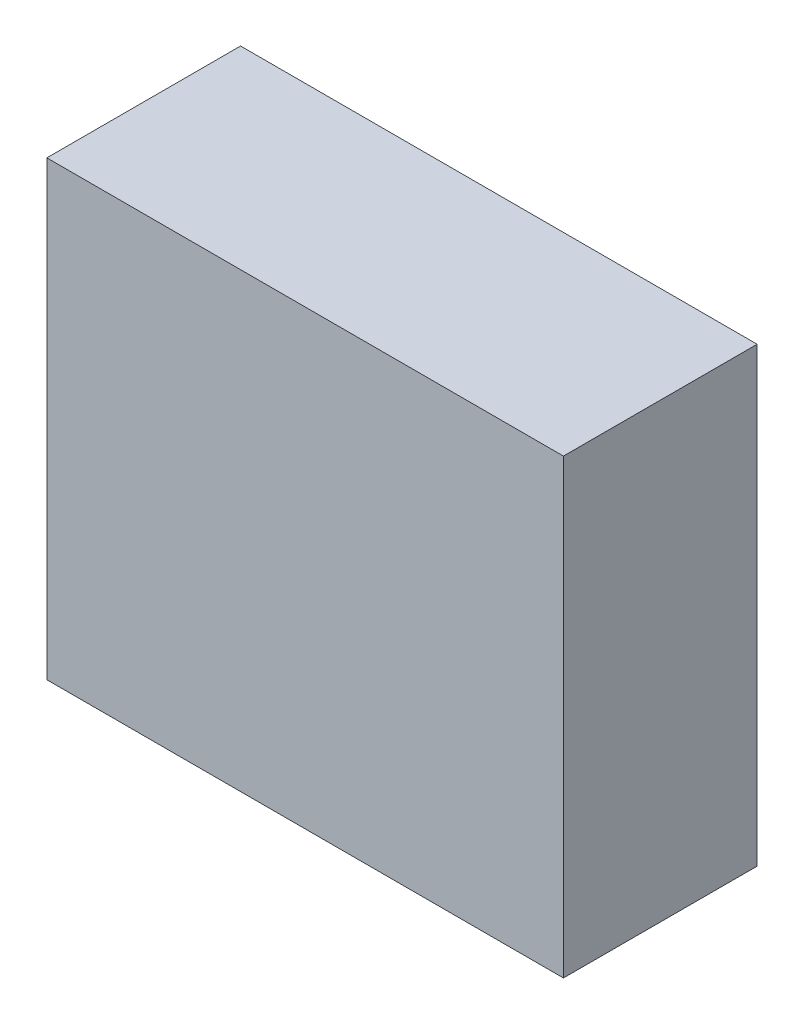
ISO-10303-21;
HEADER;
FILE_DESCRIPTION(('STEP AP214'),'2;1');
FILE_NAME('part.step','',(''),(''),'','','');
FILE_SCHEMA(('AUTOMOTIVE_DESIGN { 1 0 10303 214 1 1 1 1 }'));
ENDSEC;
DATA;
#1=APPLICATION_CONTEXT('core data for automotive mechanical design processes');
#2=APPLICATION_PROTOCOL_DEFINITION('international standard','automotive_design',2000,#1);
#3=PRODUCT_CONTEXT('',#1,'mechanical');
#4=PRODUCT('Part','Part','',(#3));
#5=PRODUCT_RELATED_PRODUCT_CATEGORY('part','',(#4));
#6=PRODUCT_DEFINITION_FORMATION('','',#4);
#7=PRODUCT_DEFINITION_CONTEXT('part definition',#1,'design');
#8=PRODUCT_DEFINITION('design','',#6,#7);
#9=PRODUCT_DEFINITION_SHAPE('','',#8);
#10=(LENGTH_UNIT() NAMED_UNIT(*) SI_UNIT(.MILLI.,.METRE.));
#11=(NAMED_UNIT(*) PLANE_ANGLE_UNIT() SI_UNIT($,.RADIAN.));
#12=(NAMED_UNIT(*) SI_UNIT($,.STERADIAN.) SOLID_ANGLE_UNIT());
#13=UNCERTAINTY_MEASURE_WITH_UNIT(LENGTH_MEASURE(1.E-05),#10,'distance_accuracy_value','');
#14=(GEOMETRIC_REPRESENTATION_CONTEXT(3) GLOBAL_UNCERTAINTY_ASSIGNED_CONTEXT((#13)) GLOBAL_UNIT_ASSIGNED_CONTEXT((#10,
#11,#12)) REPRESENTATION_CONTEXT('',''));
#15=CARTESIAN_POINT('',(0.,0.,0.));
#16=DIRECTION('',(0.,0.,1.));
#17=DIRECTION('',(1.,0.,0.));
#18=AXIS2_PLACEMENT_3D('',#15,#16,#17);
#19=CARTESIAN_POINT('',(203.2,355.6,76.2));
#20=DIRECTION('',(-1.,0.,0.));
#21=DIRECTION('',(0.,0.,1.));
#22=AXIS2_PLACEMENT_3D('',#19,#20,#21);
#23=PLANE('',#22);
#24=DIRECTION('',(0.,0.,-1.));
#25=VECTOR('',#24,1.);
#26=CARTESIAN_POINT('',(203.2,0.,76.2));
#27=LINE('',#26,#25);
#28=CARTESIAN_POINT('',(203.2,0.,76.2));
#29=VERTEX_POINT('',#28);
#30=CARTESIAN_POINT('',(203.2,0.,-76.2));
#31=VERTEX_POINT('',#30);
#32=EDGE_CURVE('E109',#29,#31,#27,.T.);
#33=ORIENTED_EDGE('',*,*,#32,.T.);
#34=DIRECTION('',(0.,-1.,0.));
#35=VECTOR('',#34,1.);
#36=CARTESIAN_POINT('',(203.2,355.6,-76.2));
#37=LINE('',#36,#35);
#38=CARTESIAN_POINT('',(203.2,355.6,-76.2));
#39=VERTEX_POINT('',#38);
#40=EDGE_CURVE('E11',#39,#31,#37,.T.);
#41=ORIENTED_EDGE('',*,*,#40,.F.);
#42=DIRECTION('',(0.,0.,-1.));
#43=VECTOR('',#42,1.);
#44=CARTESIAN_POINT('',(203.2,355.6,76.2));
#45=LINE('',#44,#43);
#46=CARTESIAN_POINT('',(203.2,355.6,76.2));
#47=VERTEX_POINT('',#46);
#48=EDGE_CURVE('E93',#47,#39,#45,.T.);
#49=ORIENTED_EDGE('',*,*,#48,.F.);
#50=DIRECTION('',(0.,-1.,0.));
#51=VECTOR('',#50,1.);
#52=CARTESIAN_POINT('',(203.2,355.6,76.2));
#53=LINE('',#52,#51);
#54=EDGE_CURVE('E105',#47,#29,#53,.T.);
#55=ORIENTED_EDGE('',*,*,#54,.T.);
#56=EDGE_LOOP('',(#33,#41,#49,#55));
#57=FACE_BOUND('',#56,.T.);
#58=ADVANCED_FACE('F41',(#57),#23,.F.);
#59=CARTESIAN_POINT('',(-203.2,355.6,-76.2));
#60=DIRECTION('',(0.,0.,1.));
#61=DIRECTION('',(1.,0.,0.));
#62=AXIS2_PLACEMENT_3D('',#59,#60,#61);
#63=PLANE('',#62);
#64=DIRECTION('',(-1.,0.,0.));
#65=VECTOR('',#64,1.);
#66=CARTESIAN_POINT('',(-203.2,0.,-76.2));
#67=LINE('',#66,#65);
#68=CARTESIAN_POINT('',(-203.2,0.,-76.2));
#69=VERTEX_POINT('',#68);
#70=EDGE_CURVE('E98',#31,#69,#67,.T.);
#71=ORIENTED_EDGE('',*,*,#70,.T.);
#72=DIRECTION('',(0.,-1.,0.));
#73=VECTOR('',#72,1.);
#74=CARTESIAN_POINT('',(-203.2,355.6,-76.2));
#75=LINE('',#74,#73);
#76=CARTESIAN_POINT('',(-203.2,355.6,-76.2));
#77=VERTEX_POINT('',#76);
#78=EDGE_CURVE('E50',#77,#69,#75,.T.);
#79=ORIENTED_EDGE('',*,*,#78,.F.);
#80=DIRECTION('',(-1.,0.,0.));
#81=VECTOR('',#80,1.);
#82=CARTESIAN_POINT('',(-203.2,355.6,-76.2));
#83=LINE('',#82,#81);
#84=EDGE_CURVE('E88',#39,#77,#83,.T.);
#85=ORIENTED_EDGE('',*,*,#84,.F.);
#86=ORIENTED_EDGE('',*,*,#40,.T.);
#87=EDGE_LOOP('',(#71,#79,#85,#86));
#88=FACE_BOUND('',#87,.T.);
#89=ADVANCED_FACE('F97',(#88),#63,.F.);
#90=CARTESIAN_POINT('',(-203.2,355.6,76.2));
#91=DIRECTION('',(1.,0.,0.));
#92=DIRECTION('',(0.,0.,-1.));
#93=AXIS2_PLACEMENT_3D('',#90,#91,#92);
#94=PLANE('',#93);
#95=DIRECTION('',(0.,0.,1.));
#96=VECTOR('',#95,1.);
#97=CARTESIAN_POINT('',(-203.2,0.,76.2));
#98=LINE('',#97,#96);
#99=CARTESIAN_POINT('',(-203.2,0.,76.2));
#100=VERTEX_POINT('',#99);
#101=EDGE_CURVE('E75',#69,#100,#98,.T.);
#102=ORIENTED_EDGE('',*,*,#101,.T.);
#103=DIRECTION('',(0.,-1.,0.));
#104=VECTOR('',#103,1.);
#105=CARTESIAN_POINT('',(-203.2,355.6,76.2));
#106=LINE('',#105,#104);
#107=CARTESIAN_POINT('',(-203.2,355.6,76.2));
#108=VERTEX_POINT('',#107);
#109=EDGE_CURVE('E100',#108,#100,#106,.T.);
#110=ORIENTED_EDGE('',*,*,#109,.F.);
#111=DIRECTION('',(0.,0.,1.));
#112=VECTOR('',#111,1.);
#113=CARTESIAN_POINT('',(-203.2,355.6,76.2));
#114=LINE('',#113,#112);
#115=EDGE_CURVE('E91',#77,#108,#114,.T.);
#116=ORIENTED_EDGE('',*,*,#115,.F.);
#117=ORIENTED_EDGE('',*,*,#78,.T.);
#118=EDGE_LOOP('',(#102,#110,#116,#117));
#119=FACE_BOUND('',#118,.T.);
#120=ADVANCED_FACE('F101',(#119),#94,.F.);
#121=CARTESIAN_POINT('',(-203.2,355.6,76.2));
#122=DIRECTION('',(0.,0.,-1.));
#123=DIRECTION('',(-1.,0.,0.));
#124=AXIS2_PLACEMENT_3D('',#121,#122,#123);
#125=PLANE('',#124);
#126=DIRECTION('',(1.,0.,0.));
#127=VECTOR('',#126,1.);
#128=CARTESIAN_POINT('',(-203.2,0.,76.2));
#129=LINE('',#128,#127);
#130=EDGE_CURVE('E81',#100,#29,#129,.T.);
#131=ORIENTED_EDGE('',*,*,#130,.T.);
#132=ORIENTED_EDGE('',*,*,#54,.F.);
#133=DIRECTION('',(1.,0.,0.));
#134=VECTOR('',#133,1.);
#135=CARTESIAN_POINT('',(-203.2,355.6,76.2));
#136=LINE('',#135,#134);
#137=EDGE_CURVE('E58',#108,#47,#136,.T.);
#138=ORIENTED_EDGE('',*,*,#137,.F.);
#139=ORIENTED_EDGE('',*,*,#109,.T.);
#140=EDGE_LOOP('',(#131,#132,#138,#139));
#141=FACE_BOUND('',#140,.T.);
#142=ADVANCED_FACE('F122',(#141),#125,.F.);
#143=CARTESIAN_POINT('',(0.,355.6,0.));
#144=DIRECTION('',(0.,-1.,0.));
#145=DIRECTION('',(0.,0.,-1.));
#146=AXIS2_PLACEMENT_3D('',#143,#144,#145);
#147=PLANE('',#146);
#148=ORIENTED_EDGE('',*,*,#48,.T.);
#149=ORIENTED_EDGE('',*,*,#84,.T.);
#150=ORIENTED_EDGE('',*,*,#115,.T.);
#151=ORIENTED_EDGE('',*,*,#137,.T.);
#152=EDGE_LOOP('',(#148,#149,#150,#151));
#153=FACE_BOUND('',#152,.T.);
#154=ADVANCED_FACE('F89',(#153),#147,.F.);
#155=CARTESIAN_POINT('',(0.,0.,0.));
#156=DIRECTION('',(0.,-1.,0.));
#157=DIRECTION('',(0.,0.,-1.));
#158=AXIS2_PLACEMENT_3D('',#155,#156,#157);
#159=PLANE('',#158);
#160=ORIENTED_EDGE('',*,*,#32,.F.);
#161=ORIENTED_EDGE('',*,*,#130,.F.);
#162=ORIENTED_EDGE('',*,*,#101,.F.);
#163=ORIENTED_EDGE('',*,*,#70,.F.);
#164=EDGE_LOOP('',(#160,#161,#162,#163));
#165=FACE_BOUND('',#164,.T.);
#166=ADVANCED_FACE('F125',(#165),#159,.T.);
#167=CLOSED_SHELL('',(#58,#89,#120,#142,#154,#166));
#168=MANIFOLD_SOLID_BREP('B2',#167);
#169=ADVANCED_BREP_SHAPE_REPRESENTATION('',(#18,#168),#14);
#170=SHAPE_DEFINITION_REPRESENTATION(#9,#169);
ENDSEC;
END-ISO-10303-21;
